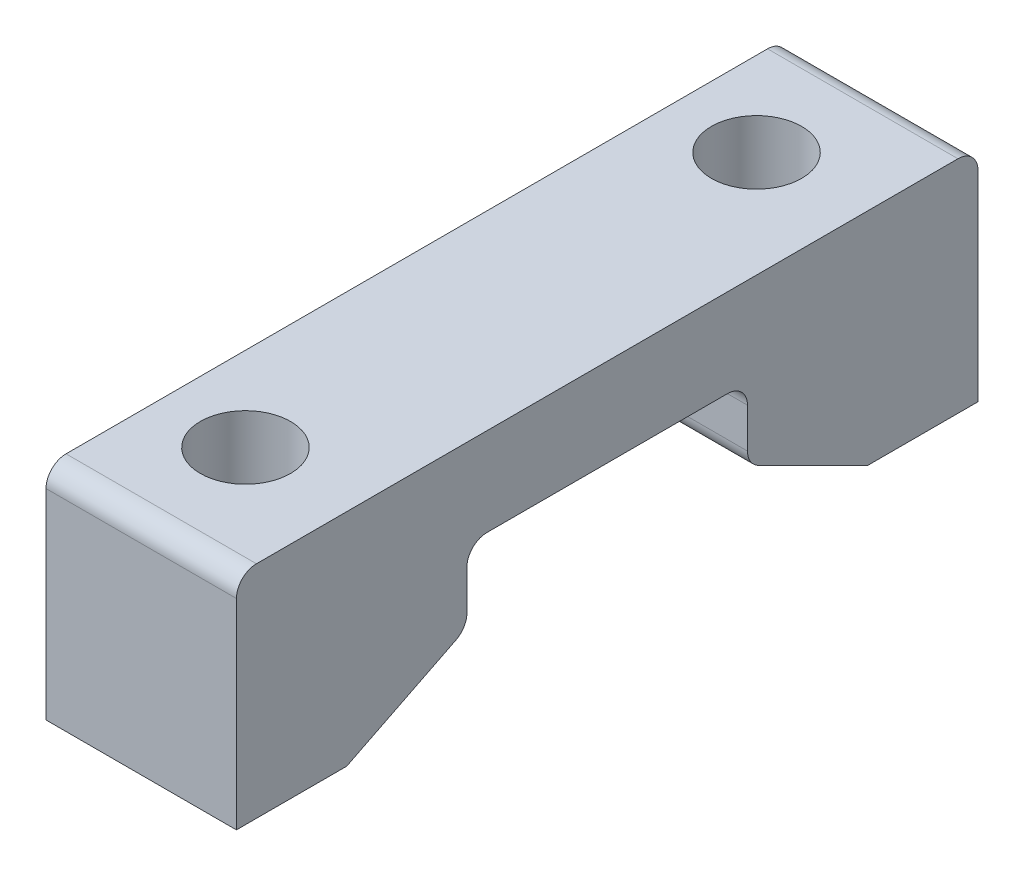
ISO-10303-21;
HEADER;
FILE_DESCRIPTION(('STEP AP214'),'2;1');
FILE_NAME('part.step','',(''),(''),'','','');
FILE_SCHEMA(('AUTOMOTIVE_DESIGN { 1 0 10303 214 1 1 1 1 }'));
ENDSEC;
DATA;
#1=APPLICATION_CONTEXT('core data for automotive mechanical design processes');
#2=APPLICATION_PROTOCOL_DEFINITION('international standard','automotive_design',2000,#1);
#3=PRODUCT_CONTEXT('',#1,'mechanical');
#4=PRODUCT('Part','Part','',(#3));
#5=PRODUCT_RELATED_PRODUCT_CATEGORY('part','',(#4));
#6=PRODUCT_DEFINITION_FORMATION('','',#4);
#7=PRODUCT_DEFINITION_CONTEXT('part definition',#1,'design');
#8=PRODUCT_DEFINITION('design','',#6,#7);
#9=PRODUCT_DEFINITION_SHAPE('','',#8);
#10=(LENGTH_UNIT() NAMED_UNIT(*) SI_UNIT(.MILLI.,.METRE.));
#11=(NAMED_UNIT(*) PLANE_ANGLE_UNIT() SI_UNIT($,.RADIAN.));
#12=(NAMED_UNIT(*) SI_UNIT($,.STERADIAN.) SOLID_ANGLE_UNIT());
#13=UNCERTAINTY_MEASURE_WITH_UNIT(LENGTH_MEASURE(1.E-05),#10,'distance_accuracy_value','');
#14=(GEOMETRIC_REPRESENTATION_CONTEXT(3) GLOBAL_UNCERTAINTY_ASSIGNED_CONTEXT((#13)) GLOBAL_UNIT_ASSIGNED_CONTEXT((#10,
#11,#12)) REPRESENTATION_CONTEXT('',''));
#15=CARTESIAN_POINT('',(0.,0.,0.));
#16=DIRECTION('',(0.,0.,1.));
#17=DIRECTION('',(1.,0.,0.));
#18=AXIS2_PLACEMENT_3D('',#15,#16,#17);
#19=CARTESIAN_POINT('',(9.5,-5.5,18.5));
#20=DIRECTION('',(0.,0.,-1.));
#21=DIRECTION('',(-1.,0.,0.));
#22=AXIS2_PLACEMENT_3D('',#19,#20,#21);
#23=PLANE('',#22);
#24=DIRECTION('',(0.,-1.,0.));
#25=VECTOR('',#24,1.);
#26=CARTESIAN_POINT('',(9.5,-5.5,18.5));
#27=LINE('',#26,#25);
#28=CARTESIAN_POINT('',(9.5,4.5,18.5));
#29=VERTEX_POINT('',#28);
#30=CARTESIAN_POINT('',(9.5,-5.5,18.5));
#31=VERTEX_POINT('',#30);
#32=EDGE_CURVE('E299',#29,#31,#27,.T.);
#33=ORIENTED_EDGE('',*,*,#32,.F.);
#34=DIRECTION('',(-1.,0.,0.));
#35=VECTOR('',#34,1.);
#36=CARTESIAN_POINT('',(9.5,4.5,18.5));
#37=LINE('',#36,#35);
#38=CARTESIAN_POINT('',(0.,4.5,18.5));
#39=VERTEX_POINT('',#38);
#40=EDGE_CURVE('E218',#29,#39,#37,.T.);
#41=ORIENTED_EDGE('',*,*,#40,.T.);
#42=DIRECTION('',(0.,-1.,0.));
#43=VECTOR('',#42,1.);
#44=CARTESIAN_POINT('',(0.,-5.5,18.5));
#45=LINE('',#44,#43);
#46=CARTESIAN_POINT('',(0.,-5.5,18.5));
#47=VERTEX_POINT('',#46);
#48=EDGE_CURVE('E280',#39,#47,#45,.T.);
#49=ORIENTED_EDGE('',*,*,#48,.T.);
#50=DIRECTION('',(-1.,0.,0.));
#51=VECTOR('',#50,1.);
#52=CARTESIAN_POINT('',(9.5,-5.5,18.5));
#53=LINE('',#52,#51);
#54=EDGE_CURVE('E193',#31,#47,#53,.T.);
#55=ORIENTED_EDGE('',*,*,#54,.F.);
#56=EDGE_LOOP('',(#33,#41,#49,#55));
#57=FACE_BOUND('',#56,.T.);
#58=ADVANCED_FACE('F36',(#57),#23,.F.);
#59=CARTESIAN_POINT('',(9.5,-5.5,13.));
#60=DIRECTION('',(0.,1.,0.));
#61=DIRECTION('',(0.,0.,1.));
#62=AXIS2_PLACEMENT_3D('',#59,#60,#61);
#63=PLANE('',#62);
#64=DIRECTION('',(-1.,0.,0.));
#65=VECTOR('',#64,1.);
#66=CARTESIAN_POINT('',(9.5,-5.5,13.));
#67=LINE('',#66,#65);
#68=CARTESIAN_POINT('',(1.96393202250021,-5.5,13.));
#69=VERTEX_POINT('',#68);
#70=CARTESIAN_POINT('',(0.,-5.5,13.));
#71=VERTEX_POINT('',#70);
#72=EDGE_CURVE('E184',#69,#71,#67,.T.);
#73=ORIENTED_EDGE('',*,*,#72,.F.);
#74=CARTESIAN_POINT('',(4.2,-5.50000000000001,12.75));
#75=DIRECTION('',(0.,1.,0.));
#76=DIRECTION('',(0.,0.,1.));
#77=AXIS2_PLACEMENT_3D('',#74,#75,#76);
#78=CIRCLE('',#77,2.25);
#79=CARTESIAN_POINT('',(6.43606797749979,-5.50000000000001,13.));
#80=VERTEX_POINT('',#79);
#81=EDGE_CURVE('E179',#69,#80,#78,.T.);
#82=ORIENTED_EDGE('',*,*,#81,.T.);
#83=CARTESIAN_POINT('',(9.5,-5.5,13.));
#84=VERTEX_POINT('',#83);
#85=EDGE_CURVE('E186',#84,#80,#67,.T.);
#86=ORIENTED_EDGE('',*,*,#85,.F.);
#87=DIRECTION('',(0.,0.,-1.));
#88=VECTOR('',#87,1.);
#89=CARTESIAN_POINT('',(9.5,-5.5,13.));
#90=LINE('',#89,#88);
#91=EDGE_CURVE('E302',#31,#84,#90,.T.);
#92=ORIENTED_EDGE('',*,*,#91,.F.);
#93=ORIENTED_EDGE('',*,*,#54,.T.);
#94=DIRECTION('',(0.,0.,-1.));
#95=VECTOR('',#94,1.);
#96=CARTESIAN_POINT('',(0.,-5.5,13.));
#97=LINE('',#96,#95);
#98=EDGE_CURVE('E282',#47,#71,#97,.T.);
#99=ORIENTED_EDGE('',*,*,#98,.T.);
#100=EDGE_LOOP('',(#73,#82,#86,#92,#93,#99));
#101=FACE_BOUND('',#100,.T.);
#102=ADVANCED_FACE('F334',(#101),#63,.F.);
#103=CARTESIAN_POINT('',(9.5,-2.5,7.));
#104=DIRECTION('',(0.,0.894427190999916,0.447213595499958));
#105=DIRECTION('',(0.,-0.447213595499958,0.894427190999916));
#106=AXIS2_PLACEMENT_3D('',#103,#104,#105);
#107=PLANE('',#106);
#108=DIRECTION('',(0.,0.447213595499958,-0.894427190999916));
#109=VECTOR('',#108,1.);
#110=CARTESIAN_POINT('',(0.,-2.5,7.));
#111=LINE('',#110,#109);
#112=CARTESIAN_POINT('',(0.,-2.77639320225002,7.55278640450004));
#113=VERTEX_POINT('',#112);
#114=EDGE_CURVE('E285',#71,#113,#111,.T.);
#115=ORIENTED_EDGE('',*,*,#114,.T.);
#116=DIRECTION('',(-1.,0.,0.));
#117=VECTOR('',#116,1.);
#118=CARTESIAN_POINT('',(9.5,-2.77639320225002,7.55278640450004));
#119=LINE('',#118,#117);
#120=CARTESIAN_POINT('',(9.5,-2.77639320225002,7.55278640450004));
#121=VERTEX_POINT('',#120);
#122=EDGE_CURVE('E233',#113,#121,#119,.F.);
#123=ORIENTED_EDGE('',*,*,#122,.T.);
#124=DIRECTION('',(0.,0.447213595499958,-0.894427190999916));
#125=VECTOR('',#124,1.);
#126=CARTESIAN_POINT('',(9.5,-2.5,7.));
#127=LINE('',#126,#125);
#128=EDGE_CURVE('E306',#84,#121,#127,.T.);
#129=ORIENTED_EDGE('',*,*,#128,.F.);
#130=ORIENTED_EDGE('',*,*,#85,.T.);
#131=CARTESIAN_POINT('',(4.2,-5.375,12.75));
#132=DIRECTION('',(0.,0.894427190999916,0.447213595499958));
#133=DIRECTION('',(0.,0.447213595499958,-0.894427190999916));
#134=AXIS2_PLACEMENT_3D('',#131,#132,#133);
#135=ELLIPSE('',#134,2.51557647468726,2.25);
#136=EDGE_CURVE('E178',#80,#69,#135,.T.);
#137=ORIENTED_EDGE('',*,*,#136,.T.);
#138=ORIENTED_EDGE('',*,*,#72,.T.);
#139=EDGE_LOOP('',(#115,#123,#129,#130,#137,#138));
#140=FACE_BOUND('',#139,.T.);
#141=ADVANCED_FACE('F328',(#140),#107,.F.);
#142=CARTESIAN_POINT('',(9.5,1.1,7.));
#143=DIRECTION('',(0.,0.,1.));
#144=DIRECTION('',(0.,-1.,0.));
#145=AXIS2_PLACEMENT_3D('',#142,#143,#144);
#146=PLANE('',#145);
#147=DIRECTION('',(0.,1.,0.));
#148=VECTOR('',#147,1.);
#149=CARTESIAN_POINT('',(9.5,1.1,7.));
#150=LINE('',#149,#148);
#151=CARTESIAN_POINT('',(9.5,-1.88196601125011,7.));
#152=VERTEX_POINT('',#151);
#153=CARTESIAN_POINT('',(9.5,0.1,7.));
#154=VERTEX_POINT('',#153);
#155=EDGE_CURVE('E270',#152,#154,#150,.T.);
#156=ORIENTED_EDGE('',*,*,#155,.F.);
#157=DIRECTION('',(-1.,0.,0.));
#158=VECTOR('',#157,1.);
#159=CARTESIAN_POINT('',(9.5,-1.88196601125011,7.));
#160=LINE('',#159,#158);
#161=CARTESIAN_POINT('',(0.,-1.88196601125011,7.));
#162=VERTEX_POINT('',#161);
#163=EDGE_CURVE('E230',#152,#162,#160,.T.);
#164=ORIENTED_EDGE('',*,*,#163,.T.);
#165=DIRECTION('',(0.,1.,0.));
#166=VECTOR('',#165,1.);
#167=CARTESIAN_POINT('',(0.,1.1,7.));
#168=LINE('',#167,#166);
#169=CARTESIAN_POINT('',(0.,0.1,7.));
#170=VERTEX_POINT('',#169);
#171=EDGE_CURVE('E259',#162,#170,#168,.T.);
#172=ORIENTED_EDGE('',*,*,#171,.T.);
#173=DIRECTION('',(-1.,0.,0.));
#174=VECTOR('',#173,1.);
#175=CARTESIAN_POINT('',(9.5,0.1,7.));
#176=LINE('',#175,#174);
#177=EDGE_CURVE('E228',#170,#154,#176,.F.);
#178=ORIENTED_EDGE('',*,*,#177,.T.);
#179=EDGE_LOOP('',(#156,#164,#172,#178));
#180=FACE_BOUND('',#179,.T.);
#181=ADVANCED_FACE('F321',(#180),#146,.F.);
#182=CARTESIAN_POINT('',(9.5,1.1,7.));
#183=DIRECTION('',(0.,1.,0.));
#184=DIRECTION('',(0.,0.,1.));
#185=AXIS2_PLACEMENT_3D('',#182,#183,#184);
#186=PLANE('',#185);
#187=DIRECTION('',(0.,0.,-1.));
#188=VECTOR('',#187,1.);
#189=CARTESIAN_POINT('',(9.5,1.1,7.));
#190=LINE('',#189,#188);
#191=CARTESIAN_POINT('',(9.5,1.1,6.));
#192=VERTEX_POINT('',#191);
#193=CARTESIAN_POINT('',(9.5,1.1,-6.));
#194=VERTEX_POINT('',#193);
#195=EDGE_CURVE('E265',#192,#194,#190,.T.);
#196=ORIENTED_EDGE('',*,*,#195,.F.);
#197=DIRECTION('',(-1.,0.,0.));
#198=VECTOR('',#197,1.);
#199=CARTESIAN_POINT('',(0.,1.1,6.));
#200=LINE('',#199,#198);
#201=CARTESIAN_POINT('',(0.,1.1,6.));
#202=VERTEX_POINT('',#201);
#203=EDGE_CURVE('E237',#192,#202,#200,.T.);
#204=ORIENTED_EDGE('',*,*,#203,.T.);
#205=DIRECTION('',(0.,0.,-1.));
#206=VECTOR('',#205,1.);
#207=CARTESIAN_POINT('',(0.,1.1,7.));
#208=LINE('',#207,#206);
#209=CARTESIAN_POINT('',(0.,1.1,-6.));
#210=VERTEX_POINT('',#209);
#211=EDGE_CURVE('E249',#202,#210,#208,.T.);
#212=ORIENTED_EDGE('',*,*,#211,.T.);
#213=DIRECTION('',(-1.,0.,0.));
#214=VECTOR('',#213,1.);
#215=CARTESIAN_POINT('',(9.5,1.1,-6.));
#216=LINE('',#215,#214);
#217=EDGE_CURVE('E235',#210,#194,#216,.F.);
#218=ORIENTED_EDGE('',*,*,#217,.T.);
#219=EDGE_LOOP('',(#196,#204,#212,#218));
#220=FACE_BOUND('',#219,.T.);
#221=ADVANCED_FACE('F256',(#220),#186,.F.);
#222=CARTESIAN_POINT('',(9.5,1.1,-7.));
#223=DIRECTION('',(0.,0.,-1.));
#224=DIRECTION('',(0.,1.,0.));
#225=AXIS2_PLACEMENT_3D('',#222,#223,#224);
#226=PLANE('',#225);
#227=DIRECTION('',(0.,-1.,0.));
#228=VECTOR('',#227,1.);
#229=CARTESIAN_POINT('',(0.,1.1,-7.));
#230=LINE('',#229,#228);
#231=CARTESIAN_POINT('',(0.,0.100000000000002,-7.));
#232=VERTEX_POINT('',#231);
#233=CARTESIAN_POINT('',(0.,-1.8819660112501,-7.));
#234=VERTEX_POINT('',#233);
#235=EDGE_CURVE('E250',#232,#234,#230,.T.);
#236=ORIENTED_EDGE('',*,*,#235,.T.);
#237=DIRECTION('',(-1.,0.,0.));
#238=VECTOR('',#237,1.);
#239=CARTESIAN_POINT('',(9.5,-1.8819660112501,-7.));
#240=LINE('',#239,#238);
#241=CARTESIAN_POINT('',(9.5,-1.8819660112501,-7.));
#242=VERTEX_POINT('',#241);
#243=EDGE_CURVE('E59',#234,#242,#240,.F.);
#244=ORIENTED_EDGE('',*,*,#243,.T.);
#245=DIRECTION('',(0.,-1.,0.));
#246=VECTOR('',#245,1.);
#247=CARTESIAN_POINT('',(9.5,1.1,-7.));
#248=LINE('',#247,#246);
#249=CARTESIAN_POINT('',(9.5,0.100000000000002,-7.));
#250=VERTEX_POINT('',#249);
#251=EDGE_CURVE('E264',#250,#242,#248,.T.);
#252=ORIENTED_EDGE('',*,*,#251,.F.);
#253=DIRECTION('',(-1.,0.,0.));
#254=VECTOR('',#253,1.);
#255=CARTESIAN_POINT('',(0.,0.100000000000002,-7.));
#256=LINE('',#255,#254);
#257=EDGE_CURVE('E224',#250,#232,#256,.T.);
#258=ORIENTED_EDGE('',*,*,#257,.T.);
#259=EDGE_LOOP('',(#236,#244,#252,#258));
#260=FACE_BOUND('',#259,.T.);
#261=ADVANCED_FACE('F266',(#260),#226,.F.);
#262=CARTESIAN_POINT('',(9.5,-2.5,-7.));
#263=DIRECTION('',(0.,0.894427190999916,-0.447213595499958));
#264=DIRECTION('',(0.,0.447213595499958,0.894427190999916));
#265=AXIS2_PLACEMENT_3D('',#262,#263,#264);
#266=PLANE('',#265);
#267=DIRECTION('',(0.,-0.447213595499958,-0.894427190999916));
#268=VECTOR('',#267,1.);
#269=CARTESIAN_POINT('',(9.5,-2.5,-7.));
#270=LINE('',#269,#268);
#271=CARTESIAN_POINT('',(9.5,-2.77639320225002,-7.55278640450004));
#272=VERTEX_POINT('',#271);
#273=CARTESIAN_POINT('',(9.5,-5.5,-13.));
#274=VERTEX_POINT('',#273);
#275=EDGE_CURVE('E267',#272,#274,#270,.T.);
#276=ORIENTED_EDGE('',*,*,#275,.F.);
#277=DIRECTION('',(-1.,0.,0.));
#278=VECTOR('',#277,1.);
#279=CARTESIAN_POINT('',(9.5,-2.77639320225002,-7.55278640450004));
#280=LINE('',#279,#278);
#281=CARTESIAN_POINT('',(0.,-2.77639320225002,-7.55278640450004));
#282=VERTEX_POINT('',#281);
#283=EDGE_CURVE('E221',#272,#282,#280,.T.);
#284=ORIENTED_EDGE('',*,*,#283,.T.);
#285=DIRECTION('',(0.,-0.447213595499958,-0.894427190999916));
#286=VECTOR('',#285,1.);
#287=CARTESIAN_POINT('',(0.,-2.5,-7.));
#288=LINE('',#287,#286);
#289=CARTESIAN_POINT('',(0.,-5.5,-13.));
#290=VERTEX_POINT('',#289);
#291=EDGE_CURVE('E291',#282,#290,#288,.T.);
#292=ORIENTED_EDGE('',*,*,#291,.T.);
#293=DIRECTION('',(-1.,0.,0.));
#294=VECTOR('',#293,1.);
#295=CARTESIAN_POINT('',(9.5,-5.5,-13.));
#296=LINE('',#295,#294);
#297=CARTESIAN_POINT('',(1.96393202250021,-5.5,-13.));
#298=VERTEX_POINT('',#297);
#299=EDGE_CURVE('E177',#298,#290,#296,.T.);
#300=ORIENTED_EDGE('',*,*,#299,.F.);
#301=CARTESIAN_POINT('',(4.2,-5.375,-12.75));
#302=DIRECTION('',(0.,0.894427190999916,-0.447213595499958));
#303=DIRECTION('',(0.,0.447213595499958,0.894427190999916));
#304=AXIS2_PLACEMENT_3D('',#301,#302,#303);
#305=ELLIPSE('',#304,2.51557647468726,2.25);
#306=CARTESIAN_POINT('',(6.43606797749979,-5.5,-13.));
#307=VERTEX_POINT('',#306);
#308=EDGE_CURVE('E164',#298,#307,#305,.T.);
#309=ORIENTED_EDGE('',*,*,#308,.T.);
#310=EDGE_CURVE('E175',#274,#307,#296,.T.);
#311=ORIENTED_EDGE('',*,*,#310,.F.);
#312=EDGE_LOOP('',(#276,#284,#292,#300,#309,#311));
#313=FACE_BOUND('',#312,.T.);
#314=ADVANCED_FACE('F174',(#313),#266,.F.);
#315=CARTESIAN_POINT('',(9.5,-5.5,-13.));
#316=DIRECTION('',(0.,1.,0.));
#317=DIRECTION('',(0.,0.,1.));
#318=AXIS2_PLACEMENT_3D('',#315,#316,#317);
#319=PLANE('',#318);
#320=ORIENTED_EDGE('',*,*,#310,.T.);
#321=CARTESIAN_POINT('',(4.2,-5.5,-12.75));
#322=DIRECTION('',(0.,1.,0.));
#323=DIRECTION('',(0.,0.,1.));
#324=AXIS2_PLACEMENT_3D('',#321,#322,#323);
#325=CIRCLE('',#324,2.25);
#326=EDGE_CURVE('E161',#307,#298,#325,.T.);
#327=ORIENTED_EDGE('',*,*,#326,.T.);
#328=ORIENTED_EDGE('',*,*,#299,.T.);
#329=DIRECTION('',(0.,0.,-1.));
#330=VECTOR('',#329,1.);
#331=CARTESIAN_POINT('',(0.,-5.5,-13.));
#332=LINE('',#331,#330);
#333=CARTESIAN_POINT('',(0.,-5.5,-18.5));
#334=VERTEX_POINT('',#333);
#335=EDGE_CURVE('E293',#290,#334,#332,.T.);
#336=ORIENTED_EDGE('',*,*,#335,.T.);
#337=DIRECTION('',(-1.,0.,0.));
#338=VECTOR('',#337,1.);
#339=CARTESIAN_POINT('',(9.5,-5.5,-18.5));
#340=LINE('',#339,#338);
#341=CARTESIAN_POINT('',(9.5,-5.5,-18.5));
#342=VERTEX_POINT('',#341);
#343=EDGE_CURVE('E188',#342,#334,#340,.T.);
#344=ORIENTED_EDGE('',*,*,#343,.F.);
#345=DIRECTION('',(0.,0.,-1.));
#346=VECTOR('',#345,1.);
#347=CARTESIAN_POINT('',(9.5,-5.5,-13.));
#348=LINE('',#347,#346);
#349=EDGE_CURVE('E183',#274,#342,#348,.T.);
#350=ORIENTED_EDGE('',*,*,#349,.F.);
#351=EDGE_LOOP('',(#320,#327,#328,#336,#344,#350));
#352=FACE_BOUND('',#351,.T.);
#353=ADVANCED_FACE('F181',(#352),#319,.F.);
#354=CARTESIAN_POINT('',(9.5,-5.5,-18.5));
#355=DIRECTION('',(0.,0.,1.));
#356=DIRECTION('',(1.,0.,0.));
#357=AXIS2_PLACEMENT_3D('',#354,#355,#356);
#358=PLANE('',#357);
#359=DIRECTION('',(0.,1.,0.));
#360=VECTOR('',#359,1.);
#361=CARTESIAN_POINT('',(0.,-5.5,-18.5));
#362=LINE('',#361,#360);
#363=CARTESIAN_POINT('',(0.,4.5,-18.5));
#364=VERTEX_POINT('',#363);
#365=EDGE_CURVE('E295',#334,#364,#362,.T.);
#366=ORIENTED_EDGE('',*,*,#365,.T.);
#367=DIRECTION('',(-1.,0.,0.));
#368=VECTOR('',#367,1.);
#369=CARTESIAN_POINT('',(9.5,4.5,-18.5));
#370=LINE('',#369,#368);
#371=CARTESIAN_POINT('',(9.5,4.5,-18.5));
#372=VERTEX_POINT('',#371);
#373=EDGE_CURVE('E209',#364,#372,#370,.F.);
#374=ORIENTED_EDGE('',*,*,#373,.T.);
#375=DIRECTION('',(0.,1.,0.));
#376=VECTOR('',#375,1.);
#377=CARTESIAN_POINT('',(9.5,-5.5,-18.5));
#378=LINE('',#377,#376);
#379=EDGE_CURVE('E275',#342,#372,#378,.T.);
#380=ORIENTED_EDGE('',*,*,#379,.F.);
#381=ORIENTED_EDGE('',*,*,#343,.T.);
#382=EDGE_LOOP('',(#366,#374,#380,#381));
#383=FACE_BOUND('',#382,.T.);
#384=ADVANCED_FACE('F354',(#383),#358,.F.);
#385=CARTESIAN_POINT('',(9.5,5.5,-18.5));
#386=DIRECTION('',(0.,-1.,0.));
#387=DIRECTION('',(0.,0.,-1.));
#388=AXIS2_PLACEMENT_3D('',#385,#386,#387);
#389=PLANE('',#388);
#390=CARTESIAN_POINT('',(4.2,5.5,12.75));
#391=DIRECTION('',(0.,1.,0.));
#392=DIRECTION('',(0.,0.,1.));
#393=AXIS2_PLACEMENT_3D('',#390,#391,#392);
#394=CIRCLE('',#393,2.25);
#395=CARTESIAN_POINT('',(4.2,5.5,15.));
#396=VERTEX_POINT('',#395);
#397=EDGE_CURVE('E169',#396,#396,#394,.T.);
#398=ORIENTED_EDGE('',*,*,#397,.F.);
#399=EDGE_LOOP('',(#398));
#400=FACE_BOUND('',#399,.T.);
#401=CARTESIAN_POINT('',(4.2,5.5,-12.75));
#402=DIRECTION('',(0.,1.,0.));
#403=DIRECTION('',(0.,0.,1.));
#404=AXIS2_PLACEMENT_3D('',#401,#402,#403);
#405=CIRCLE('',#404,2.25);
#406=CARTESIAN_POINT('',(4.2,5.5,-10.5));
#407=VERTEX_POINT('',#406);
#408=EDGE_CURVE('E170',#407,#407,#405,.T.);
#409=ORIENTED_EDGE('',*,*,#408,.F.);
#410=EDGE_LOOP('',(#409));
#411=FACE_BOUND('',#410,.T.);
#412=DIRECTION('',(0.,0.,1.));
#413=VECTOR('',#412,1.);
#414=CARTESIAN_POINT('',(9.5,5.5,-18.5));
#415=LINE('',#414,#413);
#416=CARTESIAN_POINT('',(9.5,5.5,-17.5));
#417=VERTEX_POINT('',#416);
#418=CARTESIAN_POINT('',(9.5,5.5,17.5));
#419=VERTEX_POINT('',#418);
#420=EDGE_CURVE('E277',#417,#419,#415,.T.);
#421=ORIENTED_EDGE('',*,*,#420,.F.);
#422=DIRECTION('',(-1.,0.,0.));
#423=VECTOR('',#422,1.);
#424=CARTESIAN_POINT('',(9.5,5.5,-17.5));
#425=LINE('',#424,#423);
#426=CARTESIAN_POINT('',(0.,5.5,-17.5));
#427=VERTEX_POINT('',#426);
#428=EDGE_CURVE('E198',#417,#427,#425,.T.);
#429=ORIENTED_EDGE('',*,*,#428,.T.);
#430=DIRECTION('',(0.,0.,1.));
#431=VECTOR('',#430,1.);
#432=CARTESIAN_POINT('',(0.,5.5,-18.5));
#433=LINE('',#432,#431);
#434=CARTESIAN_POINT('',(0.,5.5,17.5));
#435=VERTEX_POINT('',#434);
#436=EDGE_CURVE('E297',#427,#435,#433,.T.);
#437=ORIENTED_EDGE('',*,*,#436,.T.);
#438=DIRECTION('',(-1.,0.,0.));
#439=VECTOR('',#438,1.);
#440=CARTESIAN_POINT('',(9.5,5.5,17.5));
#441=LINE('',#440,#439);
#442=EDGE_CURVE('E196',#435,#419,#441,.F.);
#443=ORIENTED_EDGE('',*,*,#442,.T.);
#444=EDGE_LOOP('',(#421,#429,#437,#443));
#445=FACE_BOUND('',#444,.T.);
#446=ADVANCED_FACE('F343',(#400,#411,#445),#389,.F.);
#447=CARTESIAN_POINT('',(9.5,0.,0.));
#448=DIRECTION('',(1.,0.,0.));
#449=DIRECTION('',(0.,0.,-1.));
#450=AXIS2_PLACEMENT_3D('',#447,#448,#449);
#451=PLANE('',#450);
#452=ORIENTED_EDGE('',*,*,#379,.T.);
#453=CARTESIAN_POINT('',(9.5,4.5,-17.5));
#454=DIRECTION('',(1.,0.,0.));
#455=DIRECTION('',(0.,0.,-1.));
#456=AXIS2_PLACEMENT_3D('',#453,#454,#455);
#457=CIRCLE('',#456,1.);
#458=EDGE_CURVE('E216',#372,#417,#457,.T.);
#459=ORIENTED_EDGE('',*,*,#458,.T.);
#460=ORIENTED_EDGE('',*,*,#420,.T.);
#461=CARTESIAN_POINT('',(9.5,4.5,17.5));
#462=DIRECTION('',(1.,0.,0.));
#463=DIRECTION('',(0.,0.,-1.));
#464=AXIS2_PLACEMENT_3D('',#461,#462,#463);
#465=CIRCLE('',#464,1.);
#466=EDGE_CURVE('E214',#419,#29,#465,.T.);
#467=ORIENTED_EDGE('',*,*,#466,.T.);
#468=ORIENTED_EDGE('',*,*,#32,.T.);
#469=ORIENTED_EDGE('',*,*,#91,.T.);
#470=ORIENTED_EDGE('',*,*,#128,.T.);
#471=CARTESIAN_POINT('',(9.5,-1.88196601125011,8.));
#472=DIRECTION('',(1.,0.,0.));
#473=DIRECTION('',(0.,0.,-1.));
#474=AXIS2_PLACEMENT_3D('',#471,#472,#473);
#475=CIRCLE('',#474,1.);
#476=EDGE_CURVE('E211',#121,#152,#475,.T.);
#477=ORIENTED_EDGE('',*,*,#476,.T.);
#478=ORIENTED_EDGE('',*,*,#155,.T.);
#479=CARTESIAN_POINT('',(9.5,0.1,6.));
#480=DIRECTION('',(1.,0.,0.));
#481=DIRECTION('',(0.,0.,-1.));
#482=AXIS2_PLACEMENT_3D('',#479,#480,#481);
#483=CIRCLE('',#482,1.);
#484=EDGE_CURVE('E242',#154,#192,#483,.F.);
#485=ORIENTED_EDGE('',*,*,#484,.T.);
#486=ORIENTED_EDGE('',*,*,#195,.T.);
#487=CARTESIAN_POINT('',(9.5,0.100000000000002,-6.));
#488=DIRECTION('',(1.,0.,0.));
#489=DIRECTION('',(0.,0.,-1.));
#490=AXIS2_PLACEMENT_3D('',#487,#488,#489);
#491=CIRCLE('',#490,1.);
#492=EDGE_CURVE('E11',#194,#250,#491,.F.);
#493=ORIENTED_EDGE('',*,*,#492,.T.);
#494=ORIENTED_EDGE('',*,*,#251,.T.);
#495=CARTESIAN_POINT('',(9.5,-1.8819660112501,-8.));
#496=DIRECTION('',(1.,0.,0.));
#497=DIRECTION('',(0.,0.,-1.));
#498=AXIS2_PLACEMENT_3D('',#495,#496,#497);
#499=CIRCLE('',#498,1.);
#500=EDGE_CURVE('E51',#242,#272,#499,.T.);
#501=ORIENTED_EDGE('',*,*,#500,.T.);
#502=ORIENTED_EDGE('',*,*,#275,.T.);
#503=ORIENTED_EDGE('',*,*,#349,.T.);
#504=EDGE_LOOP('',(#452,#459,#460,#467,#468,#469,#470,#477,#478,#485,#486,#493,#494,#501,#502,#503));
#505=FACE_BOUND('',#504,.T.);
#506=ADVANCED_FACE('F263',(#505),#451,.T.);
#507=CARTESIAN_POINT('',(0.,0.,0.));
#508=DIRECTION('',(1.,0.,0.));
#509=DIRECTION('',(0.,0.,-1.));
#510=AXIS2_PLACEMENT_3D('',#507,#508,#509);
#511=PLANE('',#510);
#512=ORIENTED_EDGE('',*,*,#436,.F.);
#513=CARTESIAN_POINT('',(0.,4.5,-17.5));
#514=DIRECTION('',(1.,0.,0.));
#515=DIRECTION('',(0.,0.,-1.));
#516=AXIS2_PLACEMENT_3D('',#513,#514,#515);
#517=CIRCLE('',#516,1.);
#518=EDGE_CURVE('E207',#427,#364,#517,.F.);
#519=ORIENTED_EDGE('',*,*,#518,.T.);
#520=ORIENTED_EDGE('',*,*,#365,.F.);
#521=ORIENTED_EDGE('',*,*,#335,.F.);
#522=ORIENTED_EDGE('',*,*,#291,.F.);
#523=CARTESIAN_POINT('',(0.,-1.8819660112501,-8.));
#524=DIRECTION('',(1.,0.,0.));
#525=DIRECTION('',(0.,0.,-1.));
#526=AXIS2_PLACEMENT_3D('',#523,#524,#525);
#527=CIRCLE('',#526,1.);
#528=EDGE_CURVE('E203',#282,#234,#527,.F.);
#529=ORIENTED_EDGE('',*,*,#528,.T.);
#530=ORIENTED_EDGE('',*,*,#235,.F.);
#531=CARTESIAN_POINT('',(0.,0.100000000000002,-6.));
#532=DIRECTION('',(1.,0.,0.));
#533=DIRECTION('',(0.,0.,-1.));
#534=AXIS2_PLACEMENT_3D('',#531,#532,#533);
#535=CIRCLE('',#534,1.);
#536=EDGE_CURVE('E44',#232,#210,#535,.T.);
#537=ORIENTED_EDGE('',*,*,#536,.T.);
#538=ORIENTED_EDGE('',*,*,#211,.F.);
#539=CARTESIAN_POINT('',(0.,0.1,6.));
#540=DIRECTION('',(1.,0.,0.));
#541=DIRECTION('',(0.,0.,-1.));
#542=AXIS2_PLACEMENT_3D('',#539,#540,#541);
#543=CIRCLE('',#542,1.);
#544=EDGE_CURVE('E240',#202,#170,#543,.T.);
#545=ORIENTED_EDGE('',*,*,#544,.T.);
#546=ORIENTED_EDGE('',*,*,#171,.F.);
#547=CARTESIAN_POINT('',(0.,-1.88196601125011,8.));
#548=DIRECTION('',(1.,0.,0.));
#549=DIRECTION('',(0.,0.,-1.));
#550=AXIS2_PLACEMENT_3D('',#547,#548,#549);
#551=CIRCLE('',#550,1.);
#552=EDGE_CURVE('E201',#162,#113,#551,.F.);
#553=ORIENTED_EDGE('',*,*,#552,.T.);
#554=ORIENTED_EDGE('',*,*,#114,.F.);
#555=ORIENTED_EDGE('',*,*,#98,.F.);
#556=ORIENTED_EDGE('',*,*,#48,.F.);
#557=CARTESIAN_POINT('',(0.,4.5,17.5));
#558=DIRECTION('',(1.,0.,0.));
#559=DIRECTION('',(0.,0.,-1.));
#560=AXIS2_PLACEMENT_3D('',#557,#558,#559);
#561=CIRCLE('',#560,1.);
#562=EDGE_CURVE('E205',#39,#435,#561,.F.);
#563=ORIENTED_EDGE('',*,*,#562,.T.);
#564=EDGE_LOOP('',(#512,#519,#520,#521,#522,#529,#530,#537,#538,#545,#546,#553,#554,#555,#556,#563));
#565=FACE_BOUND('',#564,.T.);
#566=ADVANCED_FACE('F248',(#565),#511,.F.);
#567=CARTESIAN_POINT('',(4.2,-5.5,-12.75));
#568=DIRECTION('',(0.,1.,0.));
#569=DIRECTION('',(0.,0.,1.));
#570=AXIS2_PLACEMENT_3D('',#567,#568,#569);
#571=CYLINDRICAL_SURFACE('',#570,2.25);
#572=ORIENTED_EDGE('',*,*,#408,.T.);
#573=EDGE_LOOP('',(#572));
#574=FACE_BOUND('',#573,.T.);
#575=ORIENTED_EDGE('',*,*,#326,.F.);
#576=ORIENTED_EDGE('',*,*,#308,.F.);
#577=EDGE_LOOP('',(#575,#576));
#578=FACE_BOUND('',#577,.T.);
#579=ADVANCED_FACE('F163',(#574,#578),#571,.F.);
#580=CARTESIAN_POINT('',(4.2,-5.50000000000001,12.75));
#581=DIRECTION('',(0.,1.,0.));
#582=DIRECTION('',(0.,0.,1.));
#583=AXIS2_PLACEMENT_3D('',#580,#581,#582);
#584=CYLINDRICAL_SURFACE('',#583,2.25);
#585=ORIENTED_EDGE('',*,*,#397,.T.);
#586=EDGE_LOOP('',(#585));
#587=FACE_BOUND('',#586,.T.);
#588=ORIENTED_EDGE('',*,*,#81,.F.);
#589=ORIENTED_EDGE('',*,*,#136,.F.);
#590=EDGE_LOOP('',(#588,#589));
#591=FACE_BOUND('',#590,.T.);
#592=ADVANCED_FACE('F376',(#587,#591),#584,.F.);
#593=CARTESIAN_POINT('',(9.5,4.5,-17.5));
#594=DIRECTION('',(-1.,0.,0.));
#595=DIRECTION('',(0.,0.,1.));
#596=AXIS2_PLACEMENT_3D('',#593,#594,#595);
#597=CYLINDRICAL_SURFACE('',#596,1.);
#598=ORIENTED_EDGE('',*,*,#458,.F.);
#599=ORIENTED_EDGE('',*,*,#373,.F.);
#600=ORIENTED_EDGE('',*,*,#518,.F.);
#601=ORIENTED_EDGE('',*,*,#428,.F.);
#602=EDGE_LOOP('',(#598,#599,#600,#601));
#603=FACE_BOUND('',#602,.T.);
#604=ADVANCED_FACE('F349',(#603),#597,.T.);
#605=CARTESIAN_POINT('',(9.5,4.5,17.5));
#606=DIRECTION('',(-1.,0.,0.));
#607=DIRECTION('',(0.,0.,1.));
#608=AXIS2_PLACEMENT_3D('',#605,#606,#607);
#609=CYLINDRICAL_SURFACE('',#608,1.);
#610=ORIENTED_EDGE('',*,*,#466,.F.);
#611=ORIENTED_EDGE('',*,*,#442,.F.);
#612=ORIENTED_EDGE('',*,*,#562,.F.);
#613=ORIENTED_EDGE('',*,*,#40,.F.);
#614=EDGE_LOOP('',(#610,#611,#612,#613));
#615=FACE_BOUND('',#614,.T.);
#616=ADVANCED_FACE('F341',(#615),#609,.T.);
#617=CARTESIAN_POINT('',(9.5,-1.8819660112501,-8.));
#618=DIRECTION('',(-1.,0.,0.));
#619=DIRECTION('',(0.,0.,1.));
#620=AXIS2_PLACEMENT_3D('',#617,#618,#619);
#621=CYLINDRICAL_SURFACE('',#620,1.);
#622=ORIENTED_EDGE('',*,*,#500,.F.);
#623=ORIENTED_EDGE('',*,*,#243,.F.);
#624=ORIENTED_EDGE('',*,*,#528,.F.);
#625=ORIENTED_EDGE('',*,*,#283,.F.);
#626=EDGE_LOOP('',(#622,#623,#624,#625));
#627=FACE_BOUND('',#626,.T.);
#628=ADVANCED_FACE('F358',(#627),#621,.T.);
#629=CARTESIAN_POINT('',(9.5,-1.88196601125011,8.));
#630=DIRECTION('',(-1.,0.,0.));
#631=DIRECTION('',(0.,0.,1.));
#632=AXIS2_PLACEMENT_3D('',#629,#630,#631);
#633=CYLINDRICAL_SURFACE('',#632,1.);
#634=ORIENTED_EDGE('',*,*,#476,.F.);
#635=ORIENTED_EDGE('',*,*,#122,.F.);
#636=ORIENTED_EDGE('',*,*,#552,.F.);
#637=ORIENTED_EDGE('',*,*,#163,.F.);
#638=EDGE_LOOP('',(#634,#635,#636,#637));
#639=FACE_BOUND('',#638,.T.);
#640=ADVANCED_FACE('F323',(#639),#633,.T.);
#641=CARTESIAN_POINT('',(9.5,0.1,6.));
#642=DIRECTION('',(1.,0.,0.));
#643=DIRECTION('',(0.,0.,-1.));
#644=AXIS2_PLACEMENT_3D('',#641,#642,#643);
#645=CYLINDRICAL_SURFACE('',#644,1.);
#646=ORIENTED_EDGE('',*,*,#484,.F.);
#647=ORIENTED_EDGE('',*,*,#177,.F.);
#648=ORIENTED_EDGE('',*,*,#544,.F.);
#649=ORIENTED_EDGE('',*,*,#203,.F.);
#650=EDGE_LOOP('',(#646,#647,#648,#649));
#651=FACE_BOUND('',#650,.T.);
#652=ADVANCED_FACE('F319',(#651),#645,.F.);
#653=CARTESIAN_POINT('',(9.5,0.100000000000002,-6.));
#654=DIRECTION('',(1.,0.,0.));
#655=DIRECTION('',(0.,0.,-1.));
#656=AXIS2_PLACEMENT_3D('',#653,#654,#655);
#657=CYLINDRICAL_SURFACE('',#656,1.);
#658=ORIENTED_EDGE('',*,*,#492,.F.);
#659=ORIENTED_EDGE('',*,*,#217,.F.);
#660=ORIENTED_EDGE('',*,*,#536,.F.);
#661=ORIENTED_EDGE('',*,*,#257,.F.);
#662=EDGE_LOOP('',(#658,#659,#660,#661));
#663=FACE_BOUND('',#662,.T.);
#664=ADVANCED_FACE('F38',(#663),#657,.F.);
#665=CLOSED_SHELL('',(#58,#102,#141,#181,#221,#261,#314,#353,#384,#446,#506,#566,#579,#592,#604,
#616,#628,#640,#652,#664));
#666=MANIFOLD_SOLID_BREP('B2',#665);
#667=ADVANCED_BREP_SHAPE_REPRESENTATION('',(#18,#666),#14);
#668=SHAPE_DEFINITION_REPRESENTATION(#9,#667);
ENDSEC;
END-ISO-10303-21;
